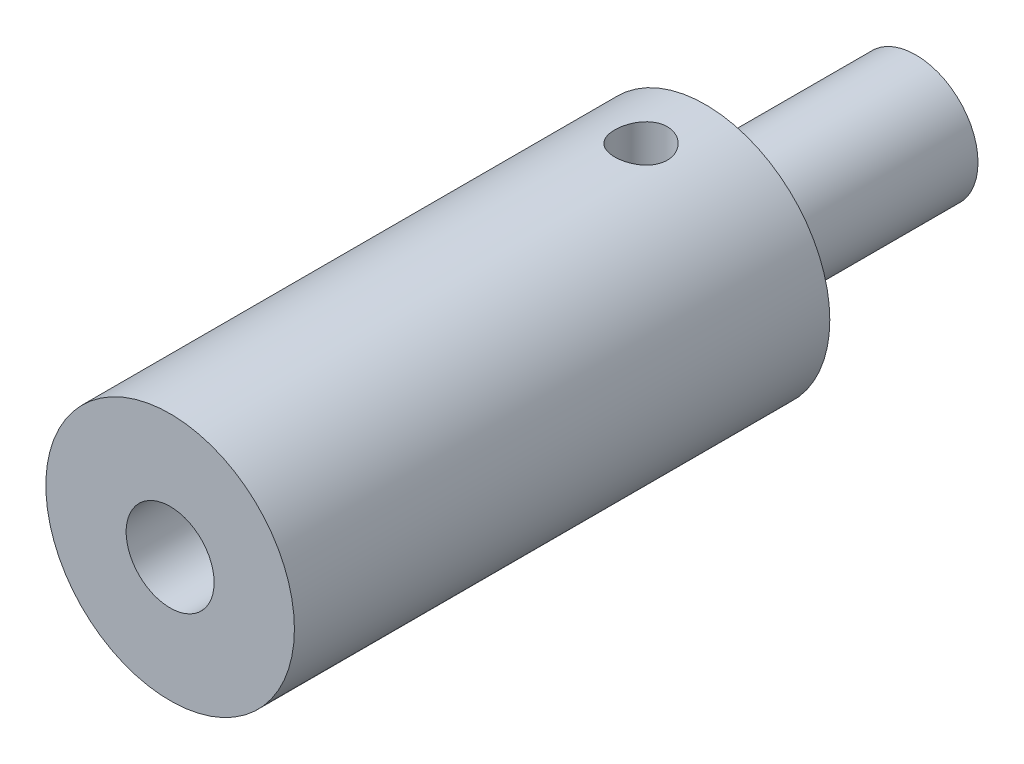
ISO-10303-21;
HEADER;
FILE_DESCRIPTION(('STEP AP214'),'2;1');
FILE_NAME('part.step','',(''),(''),'','','');
FILE_SCHEMA(('AUTOMOTIVE_DESIGN { 1 0 10303 214 1 1 1 1 }'));
ENDSEC;
DATA;
#1=APPLICATION_CONTEXT('core data for automotive mechanical design processes');
#2=APPLICATION_PROTOCOL_DEFINITION('international standard','automotive_design',2000,#1);
#3=PRODUCT_CONTEXT('',#1,'mechanical');
#4=PRODUCT('Part','Part','',(#3));
#5=PRODUCT_RELATED_PRODUCT_CATEGORY('part','',(#4));
#6=PRODUCT_DEFINITION_FORMATION('','',#4);
#7=PRODUCT_DEFINITION_CONTEXT('part definition',#1,'design');
#8=PRODUCT_DEFINITION('design','',#6,#7);
#9=PRODUCT_DEFINITION_SHAPE('','',#8);
#10=(LENGTH_UNIT() NAMED_UNIT(*) SI_UNIT(.MILLI.,.METRE.));
#11=(NAMED_UNIT(*) PLANE_ANGLE_UNIT() SI_UNIT($,.RADIAN.));
#12=(NAMED_UNIT(*) SI_UNIT($,.STERADIAN.) SOLID_ANGLE_UNIT());
#13=UNCERTAINTY_MEASURE_WITH_UNIT(LENGTH_MEASURE(1.E-05),#10,'distance_accuracy_value','');
#14=(GEOMETRIC_REPRESENTATION_CONTEXT(3) GLOBAL_UNCERTAINTY_ASSIGNED_CONTEXT((#13)) GLOBAL_UNIT_ASSIGNED_CONTEXT((#10,
#11,#12)) REPRESENTATION_CONTEXT('',''));
#15=CARTESIAN_POINT('',(0.,0.,0.));
#16=DIRECTION('',(0.,0.,1.));
#17=DIRECTION('',(1.,0.,0.));
#18=AXIS2_PLACEMENT_3D('',#15,#16,#17);
#19=CARTESIAN_POINT('',(0.,0.,40.));
#20=DIRECTION('',(0.,0.,1.));
#21=DIRECTION('',(1.,0.,0.));
#22=AXIS2_PLACEMENT_3D('',#19,#20,#21);
#23=PLANE('',#22);
#24=CARTESIAN_POINT('',(0.,0.,40.));
#25=DIRECTION('',(0.,0.,1.));
#26=DIRECTION('',(1.,0.,0.));
#27=AXIS2_PLACEMENT_3D('',#24,#25,#26);
#28=CIRCLE('',#27,13.);
#29=CARTESIAN_POINT('',(13.,0.,40.));
#30=VERTEX_POINT('',#29);
#31=EDGE_CURVE('E109',#30,#30,#28,.T.);
#32=ORIENTED_EDGE('',*,*,#31,.T.);
#33=EDGE_LOOP('',(#32));
#34=FACE_BOUND('',#33,.T.);
#35=CARTESIAN_POINT('',(0.,0.,40.));
#36=DIRECTION('',(0.,0.,1.));
#37=DIRECTION('',(1.,0.,0.));
#38=AXIS2_PLACEMENT_3D('',#35,#36,#37);
#39=CIRCLE('',#38,4.6);
#40=CARTESIAN_POINT('',(4.6,0.,40.));
#41=VERTEX_POINT('',#40);
#42=EDGE_CURVE('E112',#41,#41,#39,.T.);
#43=ORIENTED_EDGE('',*,*,#42,.F.);
#44=EDGE_LOOP('',(#43));
#45=FACE_BOUND('',#44,.T.);
#46=ADVANCED_FACE('F43',(#34,#45),#23,.T.);
#47=CARTESIAN_POINT('',(0.,0.,40.));
#48=DIRECTION('',(0.,0.,-1.));
#49=DIRECTION('',(-1.,0.,0.));
#50=AXIS2_PLACEMENT_3D('',#47,#48,#49);
#51=CYLINDRICAL_SURFACE('',#50,13.);
#52=CARTESIAN_POINT('',(0.,-13.,-6.5));
#53=CARTESIAN_POINT('',(0.152645962077536,-12.9999971744906,-6.50000537924892));
#54=CARTESIAN_POINT('',(0.305358081593092,-12.9972840185269,-6.51275244607873));
#55=CARTESIAN_POINT('',(0.606452918633867,-12.9867226158947,-6.56335589366979));
#56=CARTESIAN_POINT('',(0.75483232001695,-12.9788705383579,-6.60123100671147));
#57=CARTESIAN_POINT('',(1.04286600858037,-12.9589065584159,-6.70085780226605));
#58=CARTESIAN_POINT('',(1.1825289483597,-12.9467989621788,-6.76258535470068));
#59=CARTESIAN_POINT('',(1.44950915874221,-12.9196344100821,-6.90809011672705));
#60=CARTESIAN_POINT('',(1.57682691085872,-12.9045775693246,-6.99186646585084));
#61=CARTESIAN_POINT('',(1.81742731787956,-12.8729134147956,-7.18042716793185));
#62=CARTESIAN_POINT('',(1.93049731572373,-12.8562879150842,-7.28547983880073));
#63=CARTESIAN_POINT('',(2.13754963698808,-12.8234900046329,-7.51303478489724));
#64=CARTESIAN_POINT('',(2.23153034437314,-12.807317632353,-7.63553853598227));
#65=CARTESIAN_POINT('',(2.39866154698486,-12.777078477976,-7.89607377837681));
#66=CARTESIAN_POINT('',(2.47158808861181,-12.7630350383439,-8.03425188443456));
#67=CARTESIAN_POINT('',(2.59310501909661,-12.7389037851321,-8.32124730505201));
#68=CARTESIAN_POINT('',(2.64169811670187,-12.7288155312966,-8.47006343330115));
#69=CARTESIAN_POINT('',(2.71247084624843,-12.7139216369823,-8.7718110076379));
#70=CARTESIAN_POINT('',(2.73502567181802,-12.7090410376969,-8.92465067716463));
#71=CARTESIAN_POINT('',(2.75424774699293,-12.7048897370259,-9.23201663463604));
#72=CARTESIAN_POINT('',(2.75091796637808,-12.7056183920819,-9.38654272706349));
#73=CARTESIAN_POINT('',(2.7187678390813,-12.7125353119635,-9.69012340171508));
#74=CARTESIAN_POINT('',(2.69038106544394,-12.7186307089704,-9.83922633525146));
#75=CARTESIAN_POINT('',(2.60960866130122,-12.7354477253007,-10.1305045573943));
#76=CARTESIAN_POINT('',(2.5572217628024,-12.7461695890515,-10.2726794795355));
#77=CARTESIAN_POINT('',(2.42953184269831,-12.7711243188877,-10.5472967689874));
#78=CARTESIAN_POINT('',(2.35406008972322,-12.7853828852002,-10.6796582481492));
#79=CARTESIAN_POINT('',(2.1824616265169,-12.8157883911993,-10.9299994049792));
#80=CARTESIAN_POINT('',(2.08633227384418,-12.8319355723498,-11.0479772397175));
#81=CARTESIAN_POINT('',(1.87384189159505,-12.8646989180577,-11.2687006107151));
#82=CARTESIAN_POINT('',(1.75711163256378,-12.8813179699135,-11.3710905910432));
#83=CARTESIAN_POINT('',(1.50795175353122,-12.9128550366057,-11.554896427102));
#84=CARTESIAN_POINT('',(1.37552188371679,-12.9277730243672,-11.6363119490204));
#85=CARTESIAN_POINT('',(1.0983033928927,-12.9542707217835,-11.7759368812301));
#86=CARTESIAN_POINT('',(0.953491839338138,-12.9658440551888,-11.8341020468367));
#87=CARTESIAN_POINT('',(0.655851943601511,-12.9843006958433,-11.9251766670562));
#88=CARTESIAN_POINT('',(0.503024693258983,-12.9911846400691,-11.9580895518542));
#89=CARTESIAN_POINT('',(0.196743640878867,-12.9993969727823,-11.9972136136044));
#90=CARTESIAN_POINT('',(0.0433545564310915,-13.0008264737952,-12.0039108286299));
#91=CARTESIAN_POINT('',(-0.262350656185,-12.9982512157821,-11.9917275063259));
#92=CARTESIAN_POINT('',(-0.414666851578383,-12.9942468003343,-11.9728485861367));
#93=CARTESIAN_POINT('',(-0.712308884622769,-12.9813172481004,-11.9104522604824));
#94=CARTESIAN_POINT('',(-0.85769009501349,-12.9724426138311,-11.8671876041847));
#95=CARTESIAN_POINT('',(-1.13913306144815,-12.9507650829168,-11.7575267568941));
#96=CARTESIAN_POINT('',(-1.27519405873758,-12.9379618669115,-11.6911286852916));
#97=CARTESIAN_POINT('',(-1.53615992023197,-12.9095968655865,-11.536057894581));
#98=CARTESIAN_POINT('',(-1.66088958128669,-12.8940002058015,-11.4470968474891));
#99=CARTESIAN_POINT('',(-1.89382467929613,-12.8618536246895,-11.2498075506241));
#100=CARTESIAN_POINT('',(-2.00202811542597,-12.8453035882709,-11.1414769592272));
#101=CARTESIAN_POINT('',(-2.20074297017916,-12.8127695848599,-10.9063000796242));
#102=CARTESIAN_POINT('',(-2.2909189287012,-12.7968002051884,-10.7791679596948));
#103=CARTESIAN_POINT('',(-2.44863982384162,-12.7675613719899,-10.5112769567139));
#104=CARTESIAN_POINT('',(-2.51618571523553,-12.7542918045655,-10.3705186488822));
#105=CARTESIAN_POINT('',(-2.62628874015814,-12.7320762445085,-10.0801113161874));
#106=CARTESIAN_POINT('',(-2.66898261893207,-12.7231066409567,-9.93051603012556));
#107=CARTESIAN_POINT('',(-2.72857630004031,-12.7104608986613,-9.62606227674194));
#108=CARTESIAN_POINT('',(-2.74547992288419,-12.7067839758766,-9.47120459245499));
#109=CARTESIAN_POINT('',(-2.75285891424671,-12.7051870263941,-9.16399841097116));
#110=CARTESIAN_POINT('',(-2.74386542111311,-12.7071512990771,-9.01166302957593));
#111=CARTESIAN_POINT('',(-2.70088690169248,-12.716354993442,-8.7107302939286));
#112=CARTESIAN_POINT('',(-2.66690213141889,-12.7235943610854,-8.56213290140024));
#113=CARTESIAN_POINT('',(-2.57515476031398,-12.7424779644021,-8.27328314828439));
#114=CARTESIAN_POINT('',(-2.51746468026713,-12.7541087568219,-8.13300681624703));
#115=CARTESIAN_POINT('',(-2.38000845156237,-12.7804708744326,-7.86404353900933));
#116=CARTESIAN_POINT('',(-2.30024017655954,-12.7952024982311,-7.73535771167035));
#117=CARTESIAN_POINT('',(-2.11910956777733,-12.8264553311746,-7.49059952947836));
#118=CARTESIAN_POINT('',(-2.01736669231322,-12.8430051614239,-7.37481239179587));
#119=CARTESIAN_POINT('',(-1.79595202920055,-12.8758322990186,-7.1617799419211));
#120=CARTESIAN_POINT('',(-1.67627611520153,-12.8921095426816,-7.064538908879));
#121=CARTESIAN_POINT('',(-1.42066876281656,-12.9227879846769,-6.89025088004786));
#122=CARTESIAN_POINT('',(-1.28455998323047,-12.9371644097812,-6.81345938804723));
#123=CARTESIAN_POINT('',(-1.00109625065506,-12.9621748814499,-6.6839637120686));
#124=CARTESIAN_POINT('',(-0.853751138149071,-12.9728121578805,-6.63123872769613));
#125=CARTESIAN_POINT('',(-0.588486618989593,-12.9871810038262,-6.56109241027281));
#126=CARTESIAN_POINT('',(-0.472033128506385,-12.9919590062313,-6.53822532174934));
#127=CARTESIAN_POINT('',(-0.237066340083529,-12.9983695400573,-6.50767732454081));
#128=CARTESIAN_POINT('',(-0.118553122850467,-13.0000021944437,-6.4999958221839));
#129=CARTESIAN_POINT('',(0.,-13.,-6.5));
#130=B_SPLINE_CURVE_WITH_KNOTS('',3,(#52,#53,#54,#55,#56,#57,#58,#59,#60,#61,#62,#63,#64,#65,
#66,#67,#68,#69,#70,#71,#72,#73,#74,#75,#76,#77,#78,#79,#80,#81,#82,#83,#84,#85,#86,#87,#88,#89,
#90,#91,#92,#93,#94,#95,#96,#97,#98,#99,#100,#101,#102,#103,#104,#105,#106,#107,#108,#109,#110,
#111,#112,#113,#114,#115,#116,#117,#118,#119,#120,#121,#122,#123,#124,#125,#126,#127,#128,#129),
.UNSPECIFIED.,.T.,.F.,(4,2,2,2,2,2,2,2,2,2,2,2,2,2,2,2,2,2,2,2,2,2,2,2,2,2,2,2,2,2,2,2,2,2,2,2,
2,2,4),(0.,0.457504033798627,0.915349508311294,1.37273301559827,1.83009867585675,
2.29363823820455,2.75721702591176,3.2255591080224,3.69384904368927,4.15530353630205,
4.61670508632743,5.07027594517254,5.52387077019395,5.98086360494935,6.4379149313217,
6.90419238225565,7.37047725362043,7.83764527353902,8.30474982367934,8.76315205913213,
9.2215253118587,9.67523282094087,10.1289772223653,10.5888409991235,11.0487604073873,
11.5165720948162,11.9843640425152,12.4495570773074,12.914681192773,13.3703341860563,
13.8259825116446,14.2802471461342,14.7345555459593,15.1974725825382,15.6604962992783,
16.1290592926962,16.5972165423292,16.9525528495246,17.3078752647743),.UNSPECIFIED.);
#131=CARTESIAN_POINT('',(0.,-13.,-6.5));
#132=VERTEX_POINT('',#131);
#133=EDGE_CURVE('E10',#132,#132,#130,.T.);
#134=ORIENTED_EDGE('',*,*,#133,.T.);
#135=EDGE_LOOP('',(#134));
#136=FACE_BOUND('',#135,.T.);
#137=CARTESIAN_POINT('',(0.,13.,-6.5));
#138=CARTESIAN_POINT('',(-0.152645962077536,12.9999971744906,-6.50000537924892));
#139=CARTESIAN_POINT('',(-0.305358081593092,12.9972840185269,-6.51275244607873));
#140=CARTESIAN_POINT('',(-0.606452918633867,12.9867226158947,-6.56335589366979));
#141=CARTESIAN_POINT('',(-0.75483232001695,12.9788705383579,-6.60123100671147));
#142=CARTESIAN_POINT('',(-1.04286600858037,12.9589065584159,-6.70085780226605));
#143=CARTESIAN_POINT('',(-1.1825289483597,12.9467989621788,-6.76258535470068));
#144=CARTESIAN_POINT('',(-1.44950915874221,12.9196344100821,-6.90809011672705));
#145=CARTESIAN_POINT('',(-1.57682691085872,12.9045775693246,-6.99186646585084));
#146=CARTESIAN_POINT('',(-1.81742731787956,12.8729134147956,-7.18042716793185));
#147=CARTESIAN_POINT('',(-1.93049731572373,12.8562879150842,-7.28547983880073));
#148=CARTESIAN_POINT('',(-2.13754963698808,12.8234900046329,-7.51303478489724));
#149=CARTESIAN_POINT('',(-2.23153034437314,12.807317632353,-7.63553853598227));
#150=CARTESIAN_POINT('',(-2.39866154698486,12.777078477976,-7.89607377837681));
#151=CARTESIAN_POINT('',(-2.47158808861181,12.7630350383439,-8.03425188443456));
#152=CARTESIAN_POINT('',(-2.59310501909661,12.7389037851321,-8.32124730505201));
#153=CARTESIAN_POINT('',(-2.64169811670187,12.7288155312966,-8.47006343330115));
#154=CARTESIAN_POINT('',(-2.71247084624843,12.7139216369823,-8.7718110076379));
#155=CARTESIAN_POINT('',(-2.73502567181802,12.7090410376969,-8.92465067716463));
#156=CARTESIAN_POINT('',(-2.75424774699293,12.7048897370259,-9.23201663463604));
#157=CARTESIAN_POINT('',(-2.75091796637808,12.7056183920819,-9.38654272706349));
#158=CARTESIAN_POINT('',(-2.7187678390813,12.7125353119635,-9.69012340171508));
#159=CARTESIAN_POINT('',(-2.69038106544394,12.7186307089704,-9.83922633525146));
#160=CARTESIAN_POINT('',(-2.60960866130122,12.7354477253007,-10.1305045573943));
#161=CARTESIAN_POINT('',(-2.5572217628024,12.7461695890515,-10.2726794795355));
#162=CARTESIAN_POINT('',(-2.42953184269831,12.7711243188877,-10.5472967689874));
#163=CARTESIAN_POINT('',(-2.35406008972322,12.7853828852002,-10.6796582481492));
#164=CARTESIAN_POINT('',(-2.1824616265169,12.8157883911993,-10.9299994049792));
#165=CARTESIAN_POINT('',(-2.08633227384418,12.8319355723498,-11.0479772397175));
#166=CARTESIAN_POINT('',(-1.87384189159505,12.8646989180577,-11.2687006107151));
#167=CARTESIAN_POINT('',(-1.75711163256378,12.8813179699135,-11.3710905910432));
#168=CARTESIAN_POINT('',(-1.50795175353122,12.9128550366057,-11.554896427102));
#169=CARTESIAN_POINT('',(-1.37552188371679,12.9277730243672,-11.6363119490204));
#170=CARTESIAN_POINT('',(-1.0983033928927,12.9542707217835,-11.7759368812301));
#171=CARTESIAN_POINT('',(-0.953491839338138,12.9658440551888,-11.8341020468367));
#172=CARTESIAN_POINT('',(-0.655851943601511,12.9843006958433,-11.9251766670562));
#173=CARTESIAN_POINT('',(-0.503024693258983,12.9911846400691,-11.9580895518542));
#174=CARTESIAN_POINT('',(-0.196743640878867,12.9993969727823,-11.9972136136044));
#175=CARTESIAN_POINT('',(-0.0433545564310915,13.0008264737952,-12.0039108286299));
#176=CARTESIAN_POINT('',(0.262350656185,12.9982512157821,-11.9917275063259));
#177=CARTESIAN_POINT('',(0.414666851578383,12.9942468003343,-11.9728485861367));
#178=CARTESIAN_POINT('',(0.712308884622769,12.9813172481004,-11.9104522604824));
#179=CARTESIAN_POINT('',(0.85769009501349,12.9724426138311,-11.8671876041847));
#180=CARTESIAN_POINT('',(1.13913306144815,12.9507650829168,-11.7575267568941));
#181=CARTESIAN_POINT('',(1.27519405873758,12.9379618669115,-11.6911286852916));
#182=CARTESIAN_POINT('',(1.53615992023197,12.9095968655865,-11.536057894581));
#183=CARTESIAN_POINT('',(1.66088958128669,12.8940002058015,-11.4470968474891));
#184=CARTESIAN_POINT('',(1.89382467929613,12.8618536246895,-11.2498075506241));
#185=CARTESIAN_POINT('',(2.00202811542597,12.8453035882709,-11.1414769592272));
#186=CARTESIAN_POINT('',(2.20074297017916,12.8127695848599,-10.9063000796242));
#187=CARTESIAN_POINT('',(2.2909189287012,12.7968002051884,-10.7791679596948));
#188=CARTESIAN_POINT('',(2.44863982384162,12.7675613719899,-10.5112769567139));
#189=CARTESIAN_POINT('',(2.51618571523553,12.7542918045655,-10.3705186488822));
#190=CARTESIAN_POINT('',(2.62628874015814,12.7320762445085,-10.0801113161874));
#191=CARTESIAN_POINT('',(2.66898261893207,12.7231066409567,-9.93051603012556));
#192=CARTESIAN_POINT('',(2.72857630004031,12.7104608986613,-9.62606227674194));
#193=CARTESIAN_POINT('',(2.74547992288419,12.7067839758766,-9.47120459245499));
#194=CARTESIAN_POINT('',(2.75285891424671,12.7051870263941,-9.16399841097116));
#195=CARTESIAN_POINT('',(2.74386542111311,12.7071512990771,-9.01166302957593));
#196=CARTESIAN_POINT('',(2.70088690169248,12.716354993442,-8.7107302939286));
#197=CARTESIAN_POINT('',(2.66690213141889,12.7235943610854,-8.56213290140024));
#198=CARTESIAN_POINT('',(2.57515476031398,12.7424779644021,-8.27328314828439));
#199=CARTESIAN_POINT('',(2.51746468026713,12.7541087568219,-8.13300681624703));
#200=CARTESIAN_POINT('',(2.38000845156237,12.7804708744326,-7.86404353900933));
#201=CARTESIAN_POINT('',(2.30024017655954,12.7952024982311,-7.73535771167035));
#202=CARTESIAN_POINT('',(2.11910956777733,12.8264553311746,-7.49059952947836));
#203=CARTESIAN_POINT('',(2.01736669231322,12.8430051614239,-7.37481239179587));
#204=CARTESIAN_POINT('',(1.79595202920055,12.8758322990186,-7.1617799419211));
#205=CARTESIAN_POINT('',(1.67627611520153,12.8921095426816,-7.064538908879));
#206=CARTESIAN_POINT('',(1.42066876281656,12.9227879846769,-6.89025088004786));
#207=CARTESIAN_POINT('',(1.28455998323047,12.9371644097812,-6.81345938804723));
#208=CARTESIAN_POINT('',(1.00109625065506,12.9621748814499,-6.6839637120686));
#209=CARTESIAN_POINT('',(0.853751138149071,12.9728121578805,-6.63123872769613));
#210=CARTESIAN_POINT('',(0.588486618989593,12.9871810038262,-6.56109241027281));
#211=CARTESIAN_POINT('',(0.472033128506385,12.9919590062313,-6.53822532174934));
#212=CARTESIAN_POINT('',(0.237066340083529,12.9983695400573,-6.50767732454081));
#213=CARTESIAN_POINT('',(0.118553122850467,13.0000021944437,-6.4999958221839));
#214=CARTESIAN_POINT('',(0.,13.,-6.5));
#215=B_SPLINE_CURVE_WITH_KNOTS('',3,(#137,#138,#139,#140,#141,#142,#143,#144,#145,#146,#147,
#148,#149,#150,#151,#152,#153,#154,#155,#156,#157,#158,#159,#160,#161,#162,#163,#164,#165,#166,
#167,#168,#169,#170,#171,#172,#173,#174,#175,#176,#177,#178,#179,#180,#181,#182,#183,#184,#185,
#186,#187,#188,#189,#190,#191,#192,#193,#194,#195,#196,#197,#198,#199,#200,#201,#202,#203,#204,
#205,#206,#207,#208,#209,#210,#211,#212,#213,#214),.UNSPECIFIED.,.T.,.F.,(4,2,2,2,2,2,2,2,2,2,2,
2,2,2,2,2,2,2,2,2,2,2,2,2,2,2,2,2,2,2,2,2,2,2,2,2,2,2,4),(0.,0.457504033798627,
0.915349508311294,1.37273301559827,1.83009867585675,2.29363823820455,2.75721702591176,
3.2255591080224,3.69384904368927,4.15530353630205,4.61670508632743,5.07027594517254,
5.52387077019395,5.98086360494935,6.4379149313217,6.90419238225565,7.37047725362043,
7.83764527353902,8.30474982367934,8.76315205913213,9.2215253118587,9.67523282094087,
10.1289772223653,10.5888409991235,11.0487604073873,11.5165720948162,11.9843640425152,
12.4495570773074,12.914681192773,13.3703341860563,13.8259825116446,14.2802471461342,
14.7345555459593,15.1974725825382,15.6604962992783,16.1290592926962,16.5972165423292,
16.9525528495246,17.3078752647743),.UNSPECIFIED.);
#216=CARTESIAN_POINT('',(0.,13.,-6.5));
#217=VERTEX_POINT('',#216);
#218=EDGE_CURVE('E56',#217,#217,#215,.T.);
#219=ORIENTED_EDGE('',*,*,#218,.T.);
#220=EDGE_LOOP('',(#219));
#221=FACE_BOUND('',#220,.T.);
#222=ORIENTED_EDGE('',*,*,#31,.F.);
#223=EDGE_LOOP('',(#222));
#224=FACE_BOUND('',#223,.T.);
#225=CARTESIAN_POINT('',(0.,0.,-16.));
#226=DIRECTION('',(0.,0.,1.));
#227=DIRECTION('',(1.,0.,0.));
#228=AXIS2_PLACEMENT_3D('',#225,#226,#227);
#229=CIRCLE('',#228,13.);
#230=CARTESIAN_POINT('',(13.,0.,-16.));
#231=VERTEX_POINT('',#230);
#232=EDGE_CURVE('E115',#231,#231,#229,.T.);
#233=ORIENTED_EDGE('',*,*,#232,.T.);
#234=EDGE_LOOP('',(#233));
#235=FACE_BOUND('',#234,.T.);
#236=ADVANCED_FACE('F72',(#136,#221,#224,#235),#51,.T.);
#237=CARTESIAN_POINT('',(0.,0.,40.));
#238=DIRECTION('',(0.,0.,-1.));
#239=DIRECTION('',(-1.,0.,0.));
#240=AXIS2_PLACEMENT_3D('',#237,#238,#239);
#241=CYLINDRICAL_SURFACE('',#240,4.6);
#242=CARTESIAN_POINT('',(0.,0.,0.5));
#243=DIRECTION('',(0.,0.,1.));
#244=DIRECTION('',(1.,0.,0.));
#245=AXIS2_PLACEMENT_3D('',#242,#243,#244);
#246=CIRCLE('',#245,4.6);
#247=CARTESIAN_POINT('',(4.6,0.,0.5));
#248=VERTEX_POINT('',#247);
#249=EDGE_CURVE('E61',#248,#248,#246,.F.);
#250=ORIENTED_EDGE('',*,*,#249,.T.);
#251=EDGE_LOOP('',(#250));
#252=FACE_BOUND('',#251,.T.);
#253=ORIENTED_EDGE('',*,*,#42,.T.);
#254=EDGE_LOOP('',(#253));
#255=FACE_BOUND('',#254,.T.);
#256=ADVANCED_FACE('F97',(#252,#255),#241,.F.);
#257=CARTESIAN_POINT('',(0.,0.,0.));
#258=DIRECTION('',(0.,0.,1.));
#259=DIRECTION('',(1.,0.,0.));
#260=AXIS2_PLACEMENT_3D('',#257,#258,#259);
#261=PLANE('',#260);
#262=CARTESIAN_POINT('',(0.,0.,0.));
#263=DIRECTION('',(0.,0.,1.));
#264=DIRECTION('',(1.,0.,0.));
#265=AXIS2_PLACEMENT_3D('',#262,#263,#264);
#266=CIRCLE('',#265,4.1);
#267=CARTESIAN_POINT('',(4.1,0.,0.));
#268=VERTEX_POINT('',#267);
#269=EDGE_CURVE('E66',#268,#268,#266,.T.);
#270=ORIENTED_EDGE('',*,*,#269,.T.);
#271=EDGE_LOOP('',(#270));
#272=FACE_BOUND('',#271,.T.);
#273=ADVANCED_FACE('F93',(#272),#261,.T.);
#274=CARTESIAN_POINT('',(0.,0.,-16.));
#275=DIRECTION('',(0.,0.,1.));
#276=DIRECTION('',(1.,0.,0.));
#277=AXIS2_PLACEMENT_3D('',#274,#275,#276);
#278=PLANE('',#277);
#279=CARTESIAN_POINT('',(0.,0.,-16.));
#280=DIRECTION('',(0.,0.,1.));
#281=DIRECTION('',(1.,0.,0.));
#282=AXIS2_PLACEMENT_3D('',#279,#280,#281);
#283=CIRCLE('',#282,7.);
#284=CARTESIAN_POINT('',(7.,0.,-16.));
#285=VERTEX_POINT('',#284);
#286=EDGE_CURVE('E129',#285,#285,#283,.T.);
#287=ORIENTED_EDGE('',*,*,#286,.T.);
#288=EDGE_LOOP('',(#287));
#289=FACE_BOUND('',#288,.T.);
#290=ORIENTED_EDGE('',*,*,#232,.F.);
#291=EDGE_LOOP('',(#290));
#292=FACE_BOUND('',#291,.T.);
#293=ADVANCED_FACE('F89',(#289,#292),#278,.F.);
#294=CARTESIAN_POINT('',(0.,0.,-38.));
#295=DIRECTION('',(0.,0.,1.));
#296=DIRECTION('',(1.,0.,0.));
#297=AXIS2_PLACEMENT_3D('',#294,#295,#296);
#298=CYLINDRICAL_SURFACE('',#297,6.5);
#299=CARTESIAN_POINT('',(0.,0.,-16.5));
#300=DIRECTION('',(0.,0.,1.));
#301=DIRECTION('',(1.,0.,0.));
#302=AXIS2_PLACEMENT_3D('',#299,#300,#301);
#303=CIRCLE('',#302,6.5);
#304=CARTESIAN_POINT('',(6.5,0.,-16.5));
#305=VERTEX_POINT('',#304);
#306=EDGE_CURVE('E119',#305,#305,#303,.F.);
#307=ORIENTED_EDGE('',*,*,#306,.T.);
#308=EDGE_LOOP('',(#307));
#309=FACE_BOUND('',#308,.T.);
#310=CARTESIAN_POINT('',(0.,0.,-38.));
#311=DIRECTION('',(0.,0.,-1.));
#312=DIRECTION('',(-1.,0.,0.));
#313=AXIS2_PLACEMENT_3D('',#310,#311,#312);
#314=CIRCLE('',#313,6.5);
#315=CARTESIAN_POINT('',(-6.5,0.,-38.));
#316=VERTEX_POINT('',#315);
#317=EDGE_CURVE('E122',#316,#316,#314,.T.);
#318=ORIENTED_EDGE('',*,*,#317,.F.);
#319=EDGE_LOOP('',(#318));
#320=FACE_BOUND('',#319,.T.);
#321=ADVANCED_FACE('F85',(#309,#320),#298,.T.);
#322=CARTESIAN_POINT('',(0.,0.,-38.));
#323=DIRECTION('',(0.,0.,-1.));
#324=DIRECTION('',(-1.,0.,0.));
#325=AXIS2_PLACEMENT_3D('',#322,#323,#324);
#326=PLANE('',#325);
#327=ORIENTED_EDGE('',*,*,#317,.T.);
#328=EDGE_LOOP('',(#327));
#329=FACE_BOUND('',#328,.T.);
#330=ADVANCED_FACE('F80',(#329),#326,.T.);
#331=CARTESIAN_POINT('',(0.,0.,-16.5));
#332=DIRECTION('',(0.,0.,1.));
#333=DIRECTION('',(1.,0.,0.));
#334=AXIS2_PLACEMENT_3D('',#331,#332,#333);
#335=TOROIDAL_SURFACE('',#334,7.,0.5);
#336=ORIENTED_EDGE('',*,*,#286,.F.);
#337=EDGE_LOOP('',(#336));
#338=FACE_BOUND('',#337,.T.);
#339=ORIENTED_EDGE('',*,*,#306,.F.);
#340=EDGE_LOOP('',(#339));
#341=FACE_BOUND('',#340,.T.);
#342=ADVANCED_FACE('F84',(#338,#341),#335,.F.);
#343=CARTESIAN_POINT('',(0.,0.,0.5));
#344=DIRECTION('',(0.,0.,1.));
#345=DIRECTION('',(1.,0.,0.));
#346=AXIS2_PLACEMENT_3D('',#343,#344,#345);
#347=TOROIDAL_SURFACE('',#346,4.1,0.5);
#348=ORIENTED_EDGE('',*,*,#249,.F.);
#349=EDGE_LOOP('',(#348));
#350=FACE_BOUND('',#349,.T.);
#351=ORIENTED_EDGE('',*,*,#269,.F.);
#352=EDGE_LOOP('',(#351));
#353=FACE_BOUND('',#352,.T.);
#354=ADVANCED_FACE('F45',(#350,#353),#347,.F.);
#355=CARTESIAN_POINT('',(0.,-13.,-9.25));
#356=DIRECTION('',(0.,1.,0.));
#357=DIRECTION('',(0.,0.,1.));
#358=AXIS2_PLACEMENT_3D('',#355,#356,#357);
#359=CYLINDRICAL_SURFACE('',#358,2.75);
#360=ORIENTED_EDGE('',*,*,#218,.F.);
#361=EDGE_LOOP('',(#360));
#362=FACE_BOUND('',#361,.T.);
#363=ORIENTED_EDGE('',*,*,#133,.F.);
#364=EDGE_LOOP('',(#363));
#365=FACE_BOUND('',#364,.T.);
#366=ADVANCED_FACE('F75',(#362,#365),#359,.F.);
#367=CLOSED_SHELL('',(#46,#236,#256,#273,#293,#321,#330,#342,#354,#366));
#368=MANIFOLD_SOLID_BREP('B2',#367);
#369=ADVANCED_BREP_SHAPE_REPRESENTATION('',(#18,#368),#14);
#370=SHAPE_DEFINITION_REPRESENTATION(#9,#369);
ENDSEC;
END-ISO-10303-21;
